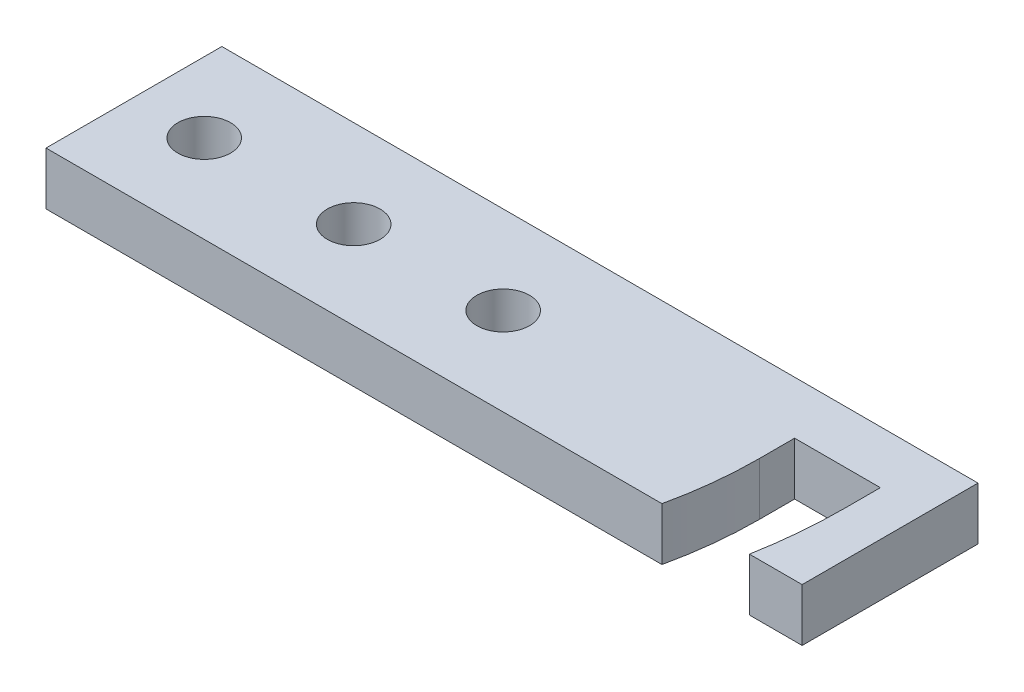
ISO-10303-21;
HEADER;
FILE_DESCRIPTION(('STEP AP214'),'2;1');
FILE_NAME('part.step','',(''),(''),'','','');
FILE_SCHEMA(('AUTOMOTIVE_DESIGN { 1 0 10303 214 1 1 1 1 }'));
ENDSEC;
DATA;
#1=APPLICATION_CONTEXT('core data for automotive mechanical design processes');
#2=APPLICATION_PROTOCOL_DEFINITION('international standard','automotive_design',2000,#1);
#3=PRODUCT_CONTEXT('',#1,'mechanical');
#4=PRODUCT('Part','Part','',(#3));
#5=PRODUCT_RELATED_PRODUCT_CATEGORY('part','',(#4));
#6=PRODUCT_DEFINITION_FORMATION('','',#4);
#7=PRODUCT_DEFINITION_CONTEXT('part definition',#1,'design');
#8=PRODUCT_DEFINITION('design','',#6,#7);
#9=PRODUCT_DEFINITION_SHAPE('','',#8);
#10=(LENGTH_UNIT() NAMED_UNIT(*) SI_UNIT(.MILLI.,.METRE.));
#11=(NAMED_UNIT(*) PLANE_ANGLE_UNIT() SI_UNIT($,.RADIAN.));
#12=(NAMED_UNIT(*) SI_UNIT($,.STERADIAN.) SOLID_ANGLE_UNIT());
#13=UNCERTAINTY_MEASURE_WITH_UNIT(LENGTH_MEASURE(1.E-05),#10,'distance_accuracy_value','');
#14=(GEOMETRIC_REPRESENTATION_CONTEXT(3) GLOBAL_UNCERTAINTY_ASSIGNED_CONTEXT((#13)) GLOBAL_UNIT_ASSIGNED_CONTEXT((#10,
#11,#12)) REPRESENTATION_CONTEXT('',''));
#15=CARTESIAN_POINT('',(0.,0.,0.));
#16=DIRECTION('',(0.,0.,1.));
#17=DIRECTION('',(1.,0.,0.));
#18=AXIS2_PLACEMENT_3D('',#15,#16,#17);
#19=CARTESIAN_POINT('',(0.,3.,0.));
#20=DIRECTION('',(0.,0.,-1.));
#21=DIRECTION('',(-1.,0.,0.));
#22=AXIS2_PLACEMENT_3D('',#19,#20,#21);
#23=PLANE('',#22);
#24=DIRECTION('',(0.,1.,0.));
#25=VECTOR('',#24,1.);
#26=CARTESIAN_POINT('',(35.0270588498489,0.,0.));
#27=LINE('',#26,#25);
#28=CARTESIAN_POINT('',(35.0270588498489,0.,0.));
#29=VERTEX_POINT('',#28);
#30=CARTESIAN_POINT('',(35.0270588498489,3.,0.));
#31=VERTEX_POINT('',#30);
#32=EDGE_CURVE('E92',#29,#31,#27,.T.);
#33=ORIENTED_EDGE('',*,*,#32,.T.);
#34=DIRECTION('',(1.,0.,0.));
#35=VECTOR('',#34,1.);
#36=CARTESIAN_POINT('',(0.,3.,0.));
#37=LINE('',#36,#35);
#38=CARTESIAN_POINT('',(0.,3.,0.));
#39=VERTEX_POINT('',#38);
#40=EDGE_CURVE('E215',#39,#31,#37,.T.);
#41=ORIENTED_EDGE('',*,*,#40,.F.);
#42=DIRECTION('',(0.,-1.,0.));
#43=VECTOR('',#42,1.);
#44=CARTESIAN_POINT('',(0.,3.,0.));
#45=LINE('',#44,#43);
#46=CARTESIAN_POINT('',(0.,0.,0.));
#47=VERTEX_POINT('',#46);
#48=EDGE_CURVE('E101',#39,#47,#45,.T.);
#49=ORIENTED_EDGE('',*,*,#48,.T.);
#50=DIRECTION('',(1.,0.,0.));
#51=VECTOR('',#50,1.);
#52=CARTESIAN_POINT('',(0.,0.,0.));
#53=LINE('',#52,#51);
#54=EDGE_CURVE('E207',#47,#29,#53,.T.);
#55=ORIENTED_EDGE('',*,*,#54,.T.);
#56=EDGE_LOOP('',(#33,#41,#49,#55));
#57=FACE_BOUND('',#56,.T.);
#58=ADVANCED_FACE('F77',(#57),#23,.F.);
#59=CARTESIAN_POINT('',(40.,0.,0.));
#60=VERTEX_POINT('',#59);
#61=CARTESIAN_POINT('',(43.,0.,0.));
#62=VERTEX_POINT('',#61);
#63=EDGE_CURVE('E188',#60,#62,#53,.T.);
#64=ORIENTED_EDGE('',*,*,#63,.T.);
#65=DIRECTION('',(0.,-1.,0.));
#66=VECTOR('',#65,1.);
#67=CARTESIAN_POINT('',(43.,3.,0.));
#68=LINE('',#67,#66);
#69=CARTESIAN_POINT('',(43.,3.,0.));
#70=VERTEX_POINT('',#69);
#71=EDGE_CURVE('E85',#70,#62,#68,.T.);
#72=ORIENTED_EDGE('',*,*,#71,.F.);
#73=CARTESIAN_POINT('',(40.,3.,0.));
#74=VERTEX_POINT('',#73);
#75=EDGE_CURVE('E128',#74,#70,#37,.T.);
#76=ORIENTED_EDGE('',*,*,#75,.F.);
#77=DIRECTION('',(0.,-1.,0.));
#78=VECTOR('',#77,1.);
#79=CARTESIAN_POINT('',(40.,3.,0.));
#80=LINE('',#79,#78);
#81=EDGE_CURVE('E12',#74,#60,#80,.T.);
#82=ORIENTED_EDGE('',*,*,#81,.T.);
#83=EDGE_LOOP('',(#64,#72,#76,#82));
#84=FACE_BOUND('',#83,.T.);
#85=ADVANCED_FACE('F273',(#84),#23,.F.);
#86=CARTESIAN_POINT('',(43.,3.,0.));
#87=DIRECTION('',(-1.,0.,0.));
#88=DIRECTION('',(0.,0.,1.));
#89=AXIS2_PLACEMENT_3D('',#86,#87,#88);
#90=PLANE('',#89);
#91=DIRECTION('',(0.,0.,-1.));
#92=VECTOR('',#91,1.);
#93=CARTESIAN_POINT('',(43.,0.,0.));
#94=LINE('',#93,#92);
#95=CARTESIAN_POINT('',(43.,0.,-10.));
#96=VERTEX_POINT('',#95);
#97=EDGE_CURVE('E231',#62,#96,#94,.T.);
#98=ORIENTED_EDGE('',*,*,#97,.T.);
#99=DIRECTION('',(0.,-1.,0.));
#100=VECTOR('',#99,1.);
#101=CARTESIAN_POINT('',(43.,3.,-10.));
#102=LINE('',#101,#100);
#103=CARTESIAN_POINT('',(43.,3.,-10.));
#104=VERTEX_POINT('',#103);
#105=EDGE_CURVE('E243',#104,#96,#102,.T.);
#106=ORIENTED_EDGE('',*,*,#105,.F.);
#107=DIRECTION('',(0.,0.,-1.));
#108=VECTOR('',#107,1.);
#109=CARTESIAN_POINT('',(43.,3.,0.));
#110=LINE('',#109,#108);
#111=EDGE_CURVE('E214',#70,#104,#110,.T.);
#112=ORIENTED_EDGE('',*,*,#111,.F.);
#113=ORIENTED_EDGE('',*,*,#71,.T.);
#114=EDGE_LOOP('',(#98,#106,#112,#113));
#115=FACE_BOUND('',#114,.T.);
#116=ADVANCED_FACE('F247',(#115),#90,.F.);
#117=CARTESIAN_POINT('',(0.,3.,-10.));
#118=DIRECTION('',(0.,0.,-1.));
#119=DIRECTION('',(-1.,0.,0.));
#120=AXIS2_PLACEMENT_3D('',#117,#118,#119);
#121=PLANE('',#120);
#122=DIRECTION('',(1.,0.,0.));
#123=VECTOR('',#122,1.);
#124=CARTESIAN_POINT('',(0.,0.,-10.));
#125=LINE('',#124,#123);
#126=CARTESIAN_POINT('',(0.,0.,-10.));
#127=VERTEX_POINT('',#126);
#128=EDGE_CURVE('E234',#127,#96,#125,.T.);
#129=ORIENTED_EDGE('',*,*,#128,.F.);
#130=DIRECTION('',(0.,-1.,0.));
#131=VECTOR('',#130,1.);
#132=CARTESIAN_POINT('',(0.,3.,-10.));
#133=LINE('',#132,#131);
#134=CARTESIAN_POINT('',(0.,3.,-10.));
#135=VERTEX_POINT('',#134);
#136=EDGE_CURVE('E241',#135,#127,#133,.T.);
#137=ORIENTED_EDGE('',*,*,#136,.F.);
#138=DIRECTION('',(1.,0.,0.));
#139=VECTOR('',#138,1.);
#140=CARTESIAN_POINT('',(0.,3.,-10.));
#141=LINE('',#140,#139);
#142=EDGE_CURVE('E217',#135,#104,#141,.T.);
#143=ORIENTED_EDGE('',*,*,#142,.T.);
#144=ORIENTED_EDGE('',*,*,#105,.T.);
#145=EDGE_LOOP('',(#129,#137,#143,#144));
#146=FACE_BOUND('',#145,.T.);
#147=ADVANCED_FACE('F252',(#146),#121,.T.);
#148=CARTESIAN_POINT('',(0.,3.,0.));
#149=DIRECTION('',(-1.,0.,0.));
#150=DIRECTION('',(0.,0.,1.));
#151=AXIS2_PLACEMENT_3D('',#148,#149,#150);
#152=PLANE('',#151);
#153=DIRECTION('',(0.,0.,-1.));
#154=VECTOR('',#153,1.);
#155=CARTESIAN_POINT('',(0.,0.,0.));
#156=LINE('',#155,#154);
#157=EDGE_CURVE('E237',#47,#127,#156,.T.);
#158=ORIENTED_EDGE('',*,*,#157,.F.);
#159=ORIENTED_EDGE('',*,*,#48,.F.);
#160=DIRECTION('',(0.,0.,-1.));
#161=VECTOR('',#160,1.);
#162=CARTESIAN_POINT('',(0.,3.,0.));
#163=LINE('',#162,#161);
#164=EDGE_CURVE('E220',#39,#135,#163,.T.);
#165=ORIENTED_EDGE('',*,*,#164,.T.);
#166=ORIENTED_EDGE('',*,*,#136,.T.);
#167=EDGE_LOOP('',(#158,#159,#165,#166));
#168=FACE_BOUND('',#167,.T.);
#169=ADVANCED_FACE('F259',(#168),#152,.T.);
#170=CARTESIAN_POINT('',(4.,3.,-4.99734883005189));
#171=DIRECTION('',(0.,-1.,0.));
#172=DIRECTION('',(0.,0.,-1.));
#173=AXIS2_PLACEMENT_3D('',#170,#171,#172);
#174=CYLINDRICAL_SURFACE('',#173,1.5);
#175=CARTESIAN_POINT('',(4.,3.,-4.99734883005189));
#176=DIRECTION('',(0.,1.,0.));
#177=DIRECTION('',(0.,0.,1.));
#178=AXIS2_PLACEMENT_3D('',#175,#176,#177);
#179=CIRCLE('',#178,1.5);
#180=CARTESIAN_POINT('',(4.,3.,-3.49734883005189));
#181=VERTEX_POINT('',#180);
#182=EDGE_CURVE('E210',#181,#181,#179,.T.);
#183=ORIENTED_EDGE('',*,*,#182,.T.);
#184=EDGE_LOOP('',(#183));
#185=FACE_BOUND('',#184,.T.);
#186=CARTESIAN_POINT('',(4.,0.,-4.99734883005189));
#187=DIRECTION('',(0.,1.,0.));
#188=DIRECTION('',(0.,0.,1.));
#189=AXIS2_PLACEMENT_3D('',#186,#187,#188);
#190=CIRCLE('',#189,1.5);
#191=CARTESIAN_POINT('',(4.,0.,-3.49734883005189));
#192=VERTEX_POINT('',#191);
#193=EDGE_CURVE('E227',#192,#192,#190,.T.);
#194=ORIENTED_EDGE('',*,*,#193,.F.);
#195=EDGE_LOOP('',(#194));
#196=FACE_BOUND('',#195,.T.);
#197=ADVANCED_FACE('F261',(#185,#196),#174,.F.);
#198=CARTESIAN_POINT('',(12.5,3.,-4.99734883005189));
#199=DIRECTION('',(0.,-1.,0.));
#200=DIRECTION('',(0.,0.,-1.));
#201=AXIS2_PLACEMENT_3D('',#198,#199,#200);
#202=CYLINDRICAL_SURFACE('',#201,1.5);
#203=CARTESIAN_POINT('',(12.5,3.,-4.99734883005189));
#204=DIRECTION('',(0.,1.,0.));
#205=DIRECTION('',(0.,0.,1.));
#206=AXIS2_PLACEMENT_3D('',#203,#204,#205);
#207=CIRCLE('',#206,1.5);
#208=CARTESIAN_POINT('',(12.5,3.,-3.49734883005189));
#209=VERTEX_POINT('',#208);
#210=EDGE_CURVE('E206',#209,#209,#207,.T.);
#211=ORIENTED_EDGE('',*,*,#210,.T.);
#212=EDGE_LOOP('',(#211));
#213=FACE_BOUND('',#212,.T.);
#214=CARTESIAN_POINT('',(12.5,0.,-4.99734883005189));
#215=DIRECTION('',(0.,1.,0.));
#216=DIRECTION('',(0.,0.,1.));
#217=AXIS2_PLACEMENT_3D('',#214,#215,#216);
#218=CIRCLE('',#217,1.5);
#219=CARTESIAN_POINT('',(12.5,0.,-3.49734883005189));
#220=VERTEX_POINT('',#219);
#221=EDGE_CURVE('E224',#220,#220,#218,.T.);
#222=ORIENTED_EDGE('',*,*,#221,.F.);
#223=EDGE_LOOP('',(#222));
#224=FACE_BOUND('',#223,.T.);
#225=ADVANCED_FACE('F267',(#213,#224),#202,.F.);
#226=CARTESIAN_POINT('',(21.,3.,-4.99734883005189));
#227=DIRECTION('',(0.,-1.,0.));
#228=DIRECTION('',(0.,0.,-1.));
#229=AXIS2_PLACEMENT_3D('',#226,#227,#228);
#230=CYLINDRICAL_SURFACE('',#229,1.5);
#231=CARTESIAN_POINT('',(21.,3.,-4.99734883005189));
#232=DIRECTION('',(0.,1.,0.));
#233=DIRECTION('',(0.,0.,1.));
#234=AXIS2_PLACEMENT_3D('',#231,#232,#233);
#235=CIRCLE('',#234,1.5);
#236=CARTESIAN_POINT('',(21.,3.,-3.49734883005189));
#237=VERTEX_POINT('',#236);
#238=EDGE_CURVE('E203',#237,#237,#235,.T.);
#239=ORIENTED_EDGE('',*,*,#238,.T.);
#240=EDGE_LOOP('',(#239));
#241=FACE_BOUND('',#240,.T.);
#242=CARTESIAN_POINT('',(21.,0.,-4.99734883005189));
#243=DIRECTION('',(0.,1.,0.));
#244=DIRECTION('',(0.,0.,1.));
#245=AXIS2_PLACEMENT_3D('',#242,#243,#244);
#246=CIRCLE('',#245,1.5);
#247=CARTESIAN_POINT('',(21.,0.,-3.49734883005189));
#248=VERTEX_POINT('',#247);
#249=EDGE_CURVE('E199',#248,#248,#246,.T.);
#250=ORIENTED_EDGE('',*,*,#249,.F.);
#251=EDGE_LOOP('',(#250));
#252=FACE_BOUND('',#251,.T.);
#253=ADVANCED_FACE('F79',(#241,#252),#230,.F.);
#254=CARTESIAN_POINT('',(0.,3.,0.));
#255=DIRECTION('',(0.,1.,0.));
#256=DIRECTION('',(0.,0.,1.));
#257=AXIS2_PLACEMENT_3D('',#254,#255,#256);
#258=PLANE('',#257);
#259=DIRECTION('',(0.,0.,1.));
#260=VECTOR('',#259,1.);
#261=CARTESIAN_POINT('',(35.5747020729148,3.,-4.99734883005189));
#262=LINE('',#261,#260);
#263=CARTESIAN_POINT('',(35.5747020729148,3.,-6.99734883005189));
#264=VERTEX_POINT('',#263);
#265=CARTESIAN_POINT('',(35.5747020729148,3.,-4.99734883005189));
#266=VERTEX_POINT('',#265);
#267=EDGE_CURVE('E175',#264,#266,#262,.T.);
#268=ORIENTED_EDGE('',*,*,#267,.F.);
#269=DIRECTION('',(-1.,0.,0.));
#270=VECTOR('',#269,1.);
#271=CARTESIAN_POINT('',(35.5747020729148,3.,-6.99734883005189));
#272=LINE('',#271,#270);
#273=CARTESIAN_POINT('',(40.4503755847613,3.,-6.99734883005189));
#274=VERTEX_POINT('',#273);
#275=EDGE_CURVE('E304',#274,#264,#272,.T.);
#276=ORIENTED_EDGE('',*,*,#275,.F.);
#277=DIRECTION('',(0.,0.,-1.));
#278=VECTOR('',#277,1.);
#279=CARTESIAN_POINT('',(40.4503755847613,3.,-6.99734883005189));
#280=LINE('',#279,#278);
#281=CARTESIAN_POINT('',(40.4503755847613,3.,-4.99734883005189));
#282=VERTEX_POINT('',#281);
#283=EDGE_CURVE('E310',#282,#274,#280,.T.);
#284=ORIENTED_EDGE('',*,*,#283,.F.);
#285=CARTESIAN_POINT('',(12.5,3.,-4.99734883005189));
#286=DIRECTION('',(0.,1.,0.));
#287=DIRECTION('',(0.,0.,1.));
#288=AXIS2_PLACEMENT_3D('',#285,#286,#287);
#289=CIRCLE('',#288,27.9503755847613);
#290=EDGE_CURVE('E181',#74,#282,#289,.T.);
#291=ORIENTED_EDGE('',*,*,#290,.F.);
#292=ORIENTED_EDGE('',*,*,#75,.T.);
#293=ORIENTED_EDGE('',*,*,#111,.T.);
#294=ORIENTED_EDGE('',*,*,#142,.F.);
#295=ORIENTED_EDGE('',*,*,#164,.F.);
#296=ORIENTED_EDGE('',*,*,#40,.T.);
#297=CARTESIAN_POINT('',(12.5,3.,-4.99734883005189));
#298=DIRECTION('',(0.,1.,0.));
#299=DIRECTION('',(0.,0.,1.));
#300=AXIS2_PLACEMENT_3D('',#297,#298,#299);
#301=CIRCLE('',#300,23.0747020729148);
#302=EDGE_CURVE('E189',#31,#266,#301,.T.);
#303=ORIENTED_EDGE('',*,*,#302,.T.);
#304=EDGE_LOOP('',(#268,#276,#284,#291,#292,#293,#294,#295,#296,#303));
#305=FACE_BOUND('',#304,.T.);
#306=ORIENTED_EDGE('',*,*,#238,.F.);
#307=EDGE_LOOP('',(#306));
#308=FACE_BOUND('',#307,.T.);
#309=ORIENTED_EDGE('',*,*,#210,.F.);
#310=EDGE_LOOP('',(#309));
#311=FACE_BOUND('',#310,.T.);
#312=ORIENTED_EDGE('',*,*,#182,.F.);
#313=EDGE_LOOP('',(#312));
#314=FACE_BOUND('',#313,.T.);
#315=ADVANCED_FACE('F256',(#305,#308,#311,#314),#258,.T.);
#316=CARTESIAN_POINT('',(0.,0.,0.));
#317=DIRECTION('',(0.,1.,0.));
#318=DIRECTION('',(0.,0.,1.));
#319=AXIS2_PLACEMENT_3D('',#316,#317,#318);
#320=PLANE('',#319);
#321=ORIENTED_EDGE('',*,*,#249,.T.);
#322=EDGE_LOOP('',(#321));
#323=FACE_BOUND('',#322,.T.);
#324=ORIENTED_EDGE('',*,*,#221,.T.);
#325=EDGE_LOOP('',(#324));
#326=FACE_BOUND('',#325,.T.);
#327=ORIENTED_EDGE('',*,*,#193,.T.);
#328=EDGE_LOOP('',(#327));
#329=FACE_BOUND('',#328,.T.);
#330=DIRECTION('',(-1.,0.,0.));
#331=VECTOR('',#330,1.);
#332=CARTESIAN_POINT('',(35.5747020729148,0.,-6.99734883005189));
#333=LINE('',#332,#331);
#334=CARTESIAN_POINT('',(40.4503755847613,0.,-6.99734883005189));
#335=VERTEX_POINT('',#334);
#336=CARTESIAN_POINT('',(35.5747020729148,0.,-6.99734883005189));
#337=VERTEX_POINT('',#336);
#338=EDGE_CURVE('E174',#335,#337,#333,.T.);
#339=ORIENTED_EDGE('',*,*,#338,.T.);
#340=DIRECTION('',(0.,0.,1.));
#341=VECTOR('',#340,1.);
#342=CARTESIAN_POINT('',(35.5747020729148,0.,-4.99734883005189));
#343=LINE('',#342,#341);
#344=CARTESIAN_POINT('',(35.5747020729148,0.,-4.99734883005189));
#345=VERTEX_POINT('',#344);
#346=EDGE_CURVE('E306',#337,#345,#343,.T.);
#347=ORIENTED_EDGE('',*,*,#346,.T.);
#348=CARTESIAN_POINT('',(12.5,0.,-4.99734883005189));
#349=DIRECTION('',(0.,1.,0.));
#350=DIRECTION('',(0.,0.,1.));
#351=AXIS2_PLACEMENT_3D('',#348,#349,#350);
#352=CIRCLE('',#351,23.0747020729148);
#353=EDGE_CURVE('E183',#29,#345,#352,.T.);
#354=ORIENTED_EDGE('',*,*,#353,.F.);
#355=ORIENTED_EDGE('',*,*,#54,.F.);
#356=ORIENTED_EDGE('',*,*,#157,.T.);
#357=ORIENTED_EDGE('',*,*,#128,.T.);
#358=ORIENTED_EDGE('',*,*,#97,.F.);
#359=ORIENTED_EDGE('',*,*,#63,.F.);
#360=CARTESIAN_POINT('',(12.5,0.,-4.99734883005189));
#361=DIRECTION('',(0.,1.,0.));
#362=DIRECTION('',(0.,0.,1.));
#363=AXIS2_PLACEMENT_3D('',#360,#361,#362);
#364=CIRCLE('',#363,27.9503755847613);
#365=CARTESIAN_POINT('',(40.4503755847613,0.,-4.99734883005189));
#366=VERTEX_POINT('',#365);
#367=EDGE_CURVE('E180',#60,#366,#364,.T.);
#368=ORIENTED_EDGE('',*,*,#367,.T.);
#369=DIRECTION('',(0.,0.,-1.));
#370=VECTOR('',#369,1.);
#371=CARTESIAN_POINT('',(40.4503755847613,0.,-6.99734883005189));
#372=LINE('',#371,#370);
#373=EDGE_CURVE('E163',#366,#335,#372,.T.);
#374=ORIENTED_EDGE('',*,*,#373,.T.);
#375=EDGE_LOOP('',(#339,#347,#354,#355,#356,#357,#358,#359,#368,#374));
#376=FACE_BOUND('',#375,.T.);
#377=ADVANCED_FACE('F186',(#323,#326,#329,#376),#320,.F.);
#378=CARTESIAN_POINT('',(12.5,0.,-4.99734883005189));
#379=DIRECTION('',(0.,1.,0.));
#380=DIRECTION('',(0.,0.,1.));
#381=AXIS2_PLACEMENT_3D('',#378,#379,#380);
#382=CYLINDRICAL_SURFACE('',#381,27.9503755847613);
#383=ORIENTED_EDGE('',*,*,#290,.T.);
#384=DIRECTION('',(0.,1.,0.));
#385=VECTOR('',#384,1.);
#386=CARTESIAN_POINT('',(40.4503755847613,0.,-4.99734883005189));
#387=LINE('',#386,#385);
#388=EDGE_CURVE('E167',#366,#282,#387,.T.);
#389=ORIENTED_EDGE('',*,*,#388,.F.);
#390=ORIENTED_EDGE('',*,*,#367,.F.);
#391=ORIENTED_EDGE('',*,*,#81,.F.);
#392=EDGE_LOOP('',(#383,#389,#390,#391));
#393=FACE_BOUND('',#392,.T.);
#394=ADVANCED_FACE('F179',(#393),#382,.F.);
#395=CARTESIAN_POINT('',(12.5,0.,-4.99734883005189));
#396=DIRECTION('',(0.,1.,0.));
#397=DIRECTION('',(0.,0.,1.));
#398=AXIS2_PLACEMENT_3D('',#395,#396,#397);
#399=CYLINDRICAL_SURFACE('',#398,23.0747020729148);
#400=ORIENTED_EDGE('',*,*,#302,.F.);
#401=ORIENTED_EDGE('',*,*,#32,.F.);
#402=ORIENTED_EDGE('',*,*,#353,.T.);
#403=DIRECTION('',(0.,1.,0.));
#404=VECTOR('',#403,1.);
#405=CARTESIAN_POINT('',(35.5747020729148,0.,-4.99734883005189));
#406=LINE('',#405,#404);
#407=EDGE_CURVE('E182',#345,#266,#406,.T.);
#408=ORIENTED_EDGE('',*,*,#407,.T.);
#409=EDGE_LOOP('',(#400,#401,#402,#408));
#410=FACE_BOUND('',#409,.T.);
#411=ADVANCED_FACE('F285',(#410),#399,.T.);
#412=CARTESIAN_POINT('',(35.5747020729148,0.,-4.99734883005189));
#413=DIRECTION('',(-1.,0.,0.));
#414=DIRECTION('',(0.,0.,1.));
#415=AXIS2_PLACEMENT_3D('',#412,#413,#414);
#416=PLANE('',#415);
#417=ORIENTED_EDGE('',*,*,#267,.T.);
#418=ORIENTED_EDGE('',*,*,#407,.F.);
#419=ORIENTED_EDGE('',*,*,#346,.F.);
#420=DIRECTION('',(0.,1.,0.));
#421=VECTOR('',#420,1.);
#422=CARTESIAN_POINT('',(35.5747020729148,0.,-6.99734883005189));
#423=LINE('',#422,#421);
#424=EDGE_CURVE('E202',#337,#264,#423,.T.);
#425=ORIENTED_EDGE('',*,*,#424,.T.);
#426=EDGE_LOOP('',(#417,#418,#419,#425));
#427=FACE_BOUND('',#426,.T.);
#428=ADVANCED_FACE('F288',(#427),#416,.F.);
#429=CARTESIAN_POINT('',(35.5747020729148,0.,-6.99734883005189));
#430=DIRECTION('',(0.,0.,-1.));
#431=DIRECTION('',(-1.,0.,0.));
#432=AXIS2_PLACEMENT_3D('',#429,#430,#431);
#433=PLANE('',#432);
#434=ORIENTED_EDGE('',*,*,#275,.T.);
#435=ORIENTED_EDGE('',*,*,#424,.F.);
#436=ORIENTED_EDGE('',*,*,#338,.F.);
#437=DIRECTION('',(0.,1.,0.));
#438=VECTOR('',#437,1.);
#439=CARTESIAN_POINT('',(40.4503755847613,0.,-6.99734883005189));
#440=LINE('',#439,#438);
#441=EDGE_CURVE('E169',#335,#274,#440,.T.);
#442=ORIENTED_EDGE('',*,*,#441,.T.);
#443=EDGE_LOOP('',(#434,#435,#436,#442));
#444=FACE_BOUND('',#443,.T.);
#445=ADVANCED_FACE('F291',(#444),#433,.F.);
#446=CARTESIAN_POINT('',(40.4503755847613,0.,-6.99734883005189));
#447=DIRECTION('',(1.,0.,0.));
#448=DIRECTION('',(0.,0.,-1.));
#449=AXIS2_PLACEMENT_3D('',#446,#447,#448);
#450=PLANE('',#449);
#451=ORIENTED_EDGE('',*,*,#283,.T.);
#452=ORIENTED_EDGE('',*,*,#441,.F.);
#453=ORIENTED_EDGE('',*,*,#373,.F.);
#454=ORIENTED_EDGE('',*,*,#388,.T.);
#455=EDGE_LOOP('',(#451,#452,#453,#454));
#456=FACE_BOUND('',#455,.T.);
#457=ADVANCED_FACE('F166',(#456),#450,.F.);
#458=CLOSED_SHELL('',(#58,#85,#116,#147,#169,#197,#225,#253,#315,#377,#394,#411,#428,#445,#457));
#459=MANIFOLD_SOLID_BREP('B2',#458);
#460=ADVANCED_BREP_SHAPE_REPRESENTATION('',(#18,#459),#14);
#461=SHAPE_DEFINITION_REPRESENTATION(#9,#460);
ENDSEC;
END-ISO-10303-21;
